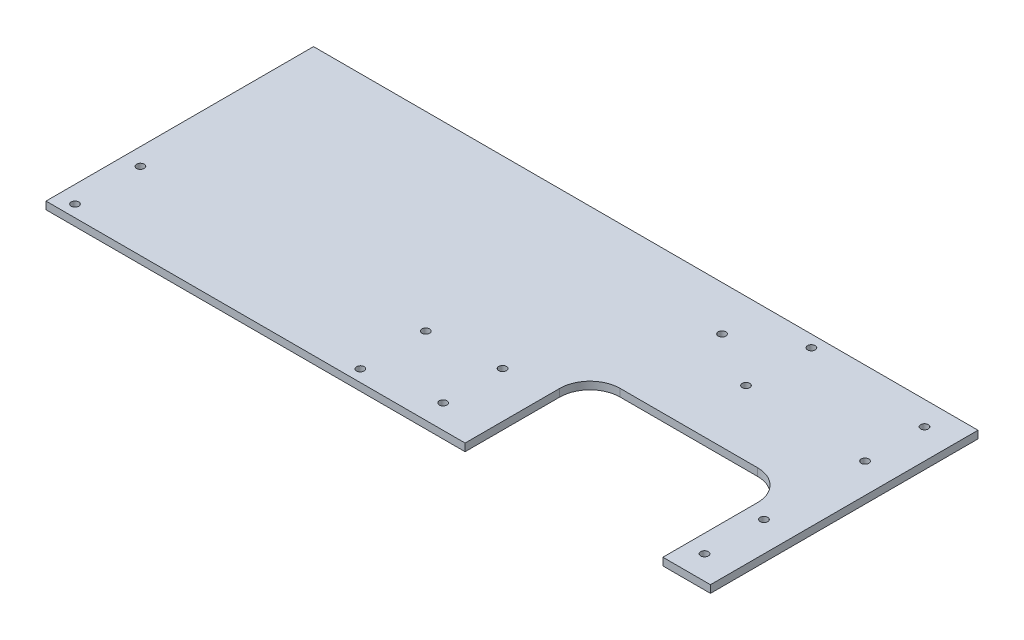
ISO-10303-21;
HEADER;
FILE_DESCRIPTION(('STEP AP214'),'2;1');
FILE_NAME('part.step','',(''),(''),'','','');
FILE_SCHEMA(('AUTOMOTIVE_DESIGN { 1 0 10303 214 1 1 1 1 }'));
ENDSEC;
DATA;
#1=APPLICATION_CONTEXT('core data for automotive mechanical design processes');
#2=APPLICATION_PROTOCOL_DEFINITION('international standard','automotive_design',2000,#1);
#3=PRODUCT_CONTEXT('',#1,'mechanical');
#4=PRODUCT('Part','Part','',(#3));
#5=PRODUCT_RELATED_PRODUCT_CATEGORY('part','',(#4));
#6=PRODUCT_DEFINITION_FORMATION('','',#4);
#7=PRODUCT_DEFINITION_CONTEXT('part definition',#1,'design');
#8=PRODUCT_DEFINITION('design','',#6,#7);
#9=PRODUCT_DEFINITION_SHAPE('','',#8);
#10=(LENGTH_UNIT() NAMED_UNIT(*) SI_UNIT(.MILLI.,.METRE.));
#11=(NAMED_UNIT(*) PLANE_ANGLE_UNIT() SI_UNIT($,.RADIAN.));
#12=(NAMED_UNIT(*) SI_UNIT($,.STERADIAN.) SOLID_ANGLE_UNIT());
#13=UNCERTAINTY_MEASURE_WITH_UNIT(LENGTH_MEASURE(1.E-05),#10,'distance_accuracy_value','');
#14=(GEOMETRIC_REPRESENTATION_CONTEXT(3) GLOBAL_UNCERTAINTY_ASSIGNED_CONTEXT((#13)) GLOBAL_UNIT_ASSIGNED_CONTEXT((#10,
#11,#12)) REPRESENTATION_CONTEXT('',''));
#15=CARTESIAN_POINT('',(0.,0.,0.));
#16=DIRECTION('',(0.,0.,1.));
#17=DIRECTION('',(1.,0.,0.));
#18=AXIS2_PLACEMENT_3D('',#15,#16,#17);
#19=CARTESIAN_POINT('',(-279.4,6.35,112.5));
#20=DIRECTION('',(0.,0.,-1.));
#21=DIRECTION('',(-1.,0.,0.));
#22=AXIS2_PLACEMENT_3D('',#19,#20,#21);
#23=PLANE('',#22);
#24=DIRECTION('',(1.,0.,0.));
#25=VECTOR('',#24,1.);
#26=CARTESIAN_POINT('',(-279.4,6.35,112.5));
#27=LINE('',#26,#25);
#28=CARTESIAN_POINT('',(239.4,6.35,112.5));
#29=VERTEX_POINT('',#28);
#30=CARTESIAN_POINT('',(279.4,6.35,112.5));
#31=VERTEX_POINT('',#30);
#32=EDGE_CURVE('E140',#29,#31,#27,.T.);
#33=ORIENTED_EDGE('',*,*,#32,.F.);
#34=DIRECTION('',(0.,-1.,0.));
#35=VECTOR('',#34,1.);
#36=CARTESIAN_POINT('',(239.4,6.35,112.5));
#37=LINE('',#36,#35);
#38=CARTESIAN_POINT('',(239.4,0.,112.5));
#39=VERTEX_POINT('',#38);
#40=EDGE_CURVE('E131',#29,#39,#37,.T.);
#41=ORIENTED_EDGE('',*,*,#40,.T.);
#42=DIRECTION('',(1.,0.,0.));
#43=VECTOR('',#42,1.);
#44=CARTESIAN_POINT('',(-279.4,0.,112.5));
#45=LINE('',#44,#43);
#46=CARTESIAN_POINT('',(279.4,0.,112.5));
#47=VERTEX_POINT('',#46);
#48=EDGE_CURVE('E155',#39,#47,#45,.T.);
#49=ORIENTED_EDGE('',*,*,#48,.T.);
#50=DIRECTION('',(0.,-1.,0.));
#51=VECTOR('',#50,1.);
#52=CARTESIAN_POINT('',(279.4,6.35,112.5));
#53=LINE('',#52,#51);
#54=EDGE_CURVE('E139',#31,#47,#53,.T.);
#55=ORIENTED_EDGE('',*,*,#54,.F.);
#56=EDGE_LOOP('',(#33,#41,#49,#55));
#57=FACE_BOUND('',#56,.T.);
#58=ADVANCED_FACE('F37',(#57),#23,.F.);
#59=CARTESIAN_POINT('',(279.4,6.35,112.5));
#60=DIRECTION('',(-1.,0.,0.));
#61=DIRECTION('',(0.,0.,1.));
#62=AXIS2_PLACEMENT_3D('',#59,#60,#61);
#63=PLANE('',#62);
#64=DIRECTION('',(0.,0.,-1.));
#65=VECTOR('',#64,1.);
#66=CARTESIAN_POINT('',(279.4,0.,112.5));
#67=LINE('',#66,#65);
#68=CARTESIAN_POINT('',(279.4,0.,-112.5));
#69=VERTEX_POINT('',#68);
#70=EDGE_CURVE('E148',#47,#69,#67,.T.);
#71=ORIENTED_EDGE('',*,*,#70,.T.);
#72=DIRECTION('',(0.,-1.,0.));
#73=VECTOR('',#72,1.);
#74=CARTESIAN_POINT('',(279.4,6.35,-112.5));
#75=LINE('',#74,#73);
#76=CARTESIAN_POINT('',(279.4,6.35,-112.5));
#77=VERTEX_POINT('',#76);
#78=EDGE_CURVE('E162',#77,#69,#75,.T.);
#79=ORIENTED_EDGE('',*,*,#78,.F.);
#80=DIRECTION('',(0.,0.,-1.));
#81=VECTOR('',#80,1.);
#82=CARTESIAN_POINT('',(279.4,6.35,112.5));
#83=LINE('',#82,#81);
#84=EDGE_CURVE('E156',#31,#77,#83,.T.);
#85=ORIENTED_EDGE('',*,*,#84,.F.);
#86=ORIENTED_EDGE('',*,*,#54,.T.);
#87=EDGE_LOOP('',(#71,#79,#85,#86));
#88=FACE_BOUND('',#87,.T.);
#89=ADVANCED_FACE('F197',(#88),#63,.F.);
#90=CARTESIAN_POINT('',(-279.4,6.35,-112.5));
#91=DIRECTION('',(0.,0.,1.));
#92=DIRECTION('',(1.,0.,0.));
#93=AXIS2_PLACEMENT_3D('',#90,#91,#92);
#94=PLANE('',#93);
#95=DIRECTION('',(-1.,0.,0.));
#96=VECTOR('',#95,1.);
#97=CARTESIAN_POINT('',(-279.4,0.,-112.5));
#98=LINE('',#97,#96);
#99=CARTESIAN_POINT('',(-279.4,0.,-112.5));
#100=VERTEX_POINT('',#99);
#101=EDGE_CURVE('E151',#69,#100,#98,.T.);
#102=ORIENTED_EDGE('',*,*,#101,.T.);
#103=DIRECTION('',(0.,-1.,0.));
#104=VECTOR('',#103,1.);
#105=CARTESIAN_POINT('',(-279.4,6.35,-112.5));
#106=LINE('',#105,#104);
#107=CARTESIAN_POINT('',(-279.4,6.35,-112.5));
#108=VERTEX_POINT('',#107);
#109=EDGE_CURVE('E159',#108,#100,#106,.T.);
#110=ORIENTED_EDGE('',*,*,#109,.F.);
#111=DIRECTION('',(-1.,0.,0.));
#112=VECTOR('',#111,1.);
#113=CARTESIAN_POINT('',(-279.4,6.35,-112.5));
#114=LINE('',#113,#112);
#115=EDGE_CURVE('E238',#77,#108,#114,.T.);
#116=ORIENTED_EDGE('',*,*,#115,.F.);
#117=ORIENTED_EDGE('',*,*,#78,.T.);
#118=EDGE_LOOP('',(#102,#110,#116,#117));
#119=FACE_BOUND('',#118,.T.);
#120=ADVANCED_FACE('F203',(#119),#94,.F.);
#121=CARTESIAN_POINT('',(-279.4,6.35,112.5));
#122=DIRECTION('',(1.,0.,0.));
#123=DIRECTION('',(0.,0.,-1.));
#124=AXIS2_PLACEMENT_3D('',#121,#122,#123);
#125=PLANE('',#124);
#126=DIRECTION('',(0.,0.,1.));
#127=VECTOR('',#126,1.);
#128=CARTESIAN_POINT('',(-279.4,0.,112.5));
#129=LINE('',#128,#127);
#130=CARTESIAN_POINT('',(-279.4,0.,112.5));
#131=VERTEX_POINT('',#130);
#132=EDGE_CURVE('E153',#100,#131,#129,.T.);
#133=ORIENTED_EDGE('',*,*,#132,.T.);
#134=DIRECTION('',(0.,-1.,0.));
#135=VECTOR('',#134,1.);
#136=CARTESIAN_POINT('',(-279.4,6.35,112.5));
#137=LINE('',#136,#135);
#138=CARTESIAN_POINT('',(-279.4,6.35,112.5));
#139=VERTEX_POINT('',#138);
#140=EDGE_CURVE('E143',#139,#131,#137,.T.);
#141=ORIENTED_EDGE('',*,*,#140,.F.);
#142=DIRECTION('',(0.,0.,1.));
#143=VECTOR('',#142,1.);
#144=CARTESIAN_POINT('',(-279.4,6.35,112.5));
#145=LINE('',#144,#143);
#146=EDGE_CURVE('E137',#108,#139,#145,.T.);
#147=ORIENTED_EDGE('',*,*,#146,.F.);
#148=ORIENTED_EDGE('',*,*,#109,.T.);
#149=EDGE_LOOP('',(#133,#141,#147,#148));
#150=FACE_BOUND('',#149,.T.);
#151=ADVANCED_FACE('F210',(#150),#125,.F.);
#152=CARTESIAN_POINT('',(73.05,0.,112.5));
#153=VERTEX_POINT('',#152);
#154=EDGE_CURVE('E130',#131,#153,#45,.T.);
#155=ORIENTED_EDGE('',*,*,#154,.T.);
#156=DIRECTION('',(0.,1.,0.));
#157=VECTOR('',#156,1.);
#158=CARTESIAN_POINT('',(73.05,6.35,112.5));
#159=LINE('',#158,#157);
#160=CARTESIAN_POINT('',(73.05,6.35,112.5));
#161=VERTEX_POINT('',#160);
#162=EDGE_CURVE('E116',#153,#161,#159,.T.);
#163=ORIENTED_EDGE('',*,*,#162,.T.);
#164=EDGE_CURVE('E128',#139,#161,#27,.T.);
#165=ORIENTED_EDGE('',*,*,#164,.F.);
#166=ORIENTED_EDGE('',*,*,#140,.T.);
#167=EDGE_LOOP('',(#155,#163,#165,#166));
#168=FACE_BOUND('',#167,.T.);
#169=ADVANCED_FACE('F126',(#168),#23,.F.);
#170=CARTESIAN_POINT('',(0.,6.35,0.));
#171=DIRECTION('',(0.,-1.,0.));
#172=DIRECTION('',(0.,0.,-1.));
#173=AXIS2_PLACEMENT_3D('',#170,#171,#172);
#174=PLANE('',#173);
#175=CARTESIAN_POINT('',(101.644095194573,6.35,-74.9999999999954));
#176=DIRECTION('',(0.,1.,0.));
#177=DIRECTION('',(0.,0.,1.));
#178=AXIS2_PLACEMENT_3D('',#175,#176,#177);
#179=CIRCLE('',#178,3.19999999999915);
#180=CARTESIAN_POINT('',(101.644095194573,6.35,-71.7999999999963));
#181=VERTEX_POINT('',#180);
#182=EDGE_CURVE('E413',#181,#181,#179,.T.);
#183=ORIENTED_EDGE('',*,*,#182,.F.);
#184=EDGE_LOOP('',(#183));
#185=FACE_BOUND('',#184,.T.);
#186=CARTESIAN_POINT('',(-25.0171688775977,6.35,102.500000000004));
#187=DIRECTION('',(0.,1.,0.));
#188=DIRECTION('',(0.,0.,1.));
#189=AXIS2_PLACEMENT_3D('',#186,#187,#188);
#190=CIRCLE('',#189,3.19999999999915);
#191=CARTESIAN_POINT('',(-25.0171688775977,6.35,105.700000000004));
#192=VERTEX_POINT('',#191);
#193=EDGE_CURVE('E416',#192,#192,#190,.T.);
#194=ORIENTED_EDGE('',*,*,#193,.F.);
#195=EDGE_LOOP('',(#194));
#196=FACE_BOUND('',#195,.T.);
#197=CARTESIAN_POINT('',(-25.0171688775977,6.35,47.5000000000044));
#198=DIRECTION('',(0.,1.,0.));
#199=DIRECTION('',(0.,0.,1.));
#200=AXIS2_PLACEMENT_3D('',#197,#198,#199);
#201=CIRCLE('',#200,3.19999999999915);
#202=CARTESIAN_POINT('',(-25.0171688775977,6.35,50.7000000000035));
#203=VERTEX_POINT('',#202);
#204=EDGE_CURVE('E433',#203,#203,#201,.T.);
#205=ORIENTED_EDGE('',*,*,#204,.F.);
#206=EDGE_LOOP('',(#205));
#207=FACE_BOUND('',#206,.T.);
#208=CARTESIAN_POINT('',(-265.017168877598,6.35,47.5000000000044));
#209=DIRECTION('',(0.,1.,0.));
#210=DIRECTION('',(0.,0.,1.));
#211=AXIS2_PLACEMENT_3D('',#208,#209,#210);
#212=CIRCLE('',#211,3.19999999999914);
#213=CARTESIAN_POINT('',(-265.017168877598,6.35,50.7000000000035));
#214=VERTEX_POINT('',#213);
#215=EDGE_CURVE('E427',#214,#214,#212,.T.);
#216=ORIENTED_EDGE('',*,*,#215,.F.);
#217=EDGE_LOOP('',(#216));
#218=FACE_BOUND('',#217,.T.);
#219=CARTESIAN_POINT('',(149.275492402717,6.35,-102.499999999996));
#220=DIRECTION('',(0.,1.,0.));
#221=DIRECTION('',(0.,0.,1.));
#222=AXIS2_PLACEMENT_3D('',#219,#220,#221);
#223=CIRCLE('',#222,3.19999999999916);
#224=CARTESIAN_POINT('',(149.275492402717,6.35,-99.2999999999964));
#225=VERTEX_POINT('',#224);
#226=EDGE_CURVE('E419',#225,#225,#223,.T.);
#227=ORIENTED_EDGE('',*,*,#226,.F.);
#228=EDGE_LOOP('',(#227));
#229=FACE_BOUND('',#228,.T.);
#230=CARTESIAN_POINT('',(149.275492402717,6.35,-47.4999999999955));
#231=DIRECTION('',(0.,1.,0.));
#232=DIRECTION('',(0.,0.,1.));
#233=AXIS2_PLACEMENT_3D('',#230,#231,#232);
#234=CIRCLE('',#233,3.19999999999913);
#235=CARTESIAN_POINT('',(149.275492402717,6.35,-44.2999999999964));
#236=VERTEX_POINT('',#235);
#237=EDGE_CURVE('E442',#236,#236,#234,.T.);
#238=ORIENTED_EDGE('',*,*,#237,.F.);
#239=EDGE_LOOP('',(#238));
#240=FACE_BOUND('',#239,.T.);
#241=CARTESIAN_POINT('',(254.400000000002,6.35,-92.4999999999956));
#242=DIRECTION('',(0.,1.,0.));
#243=DIRECTION('',(0.,0.,1.));
#244=AXIS2_PLACEMENT_3D('',#241,#242,#243);
#245=CIRCLE('',#244,3.19999999999913);
#246=CARTESIAN_POINT('',(254.400000000002,6.35,-89.2999999999965));
#247=VERTEX_POINT('',#246);
#248=EDGE_CURVE('E448',#247,#247,#245,.T.);
#249=ORIENTED_EDGE('',*,*,#248,.F.);
#250=EDGE_LOOP('',(#249));
#251=FACE_BOUND('',#250,.T.);
#252=CARTESIAN_POINT('',(254.400000000002,6.35,-42.4999999999956));
#253=DIRECTION('',(0.,1.,0.));
#254=DIRECTION('',(0.,0.,1.));
#255=AXIS2_PLACEMENT_3D('',#252,#253,#254);
#256=CIRCLE('',#255,3.19999999999913);
#257=CARTESIAN_POINT('',(254.400000000002,6.35,-39.2999999999965));
#258=VERTEX_POINT('',#257);
#259=EDGE_CURVE('E454',#258,#258,#256,.T.);
#260=ORIENTED_EDGE('',*,*,#259,.F.);
#261=EDGE_LOOP('',(#260));
#262=FACE_BOUND('',#261,.T.);
#263=CARTESIAN_POINT('',(254.400000000002,6.35,42.5000000000063));
#264=DIRECTION('',(0.,1.,0.));
#265=DIRECTION('',(0.,0.,1.));
#266=AXIS2_PLACEMENT_3D('',#263,#264,#265);
#267=CIRCLE('',#266,3.19999999999983);
#268=CARTESIAN_POINT('',(254.400000000002,6.35,45.7000000000061));
#269=VERTEX_POINT('',#268);
#270=EDGE_CURVE('E468',#269,#269,#267,.T.);
#271=ORIENTED_EDGE('',*,*,#270,.F.);
#272=EDGE_LOOP('',(#271));
#273=FACE_BOUND('',#272,.T.);
#274=CARTESIAN_POINT('',(254.400000000002,6.35,92.5000000000063));
#275=DIRECTION('',(0.,1.,0.));
#276=DIRECTION('',(0.,0.,1.));
#277=AXIS2_PLACEMENT_3D('',#274,#275,#276);
#278=CIRCLE('',#277,3.19999999999989);
#279=CARTESIAN_POINT('',(254.400000000002,6.35,95.7000000000062));
#280=VERTEX_POINT('',#279);
#281=EDGE_CURVE('E478',#280,#280,#278,.T.);
#282=ORIENTED_EDGE('',*,*,#281,.F.);
#283=EDGE_LOOP('',(#282));
#284=FACE_BOUND('',#283,.T.);
#285=CARTESIAN_POINT('',(34.5750000000003,6.35,42.5000000000044));
#286=DIRECTION('',(0.,1.,0.));
#287=DIRECTION('',(0.,0.,1.));
#288=AXIS2_PLACEMENT_3D('',#285,#286,#287);
#289=CIRCLE('',#288,3.20000000000123);
#290=CARTESIAN_POINT('',(34.5750000000003,6.35,45.7000000000056));
#291=VERTEX_POINT('',#290);
#292=EDGE_CURVE('E484',#291,#291,#289,.T.);
#293=ORIENTED_EDGE('',*,*,#292,.F.);
#294=EDGE_LOOP('',(#293));
#295=FACE_BOUND('',#294,.T.);
#296=CARTESIAN_POINT('',(34.5750000000003,6.35,92.5000000000044));
#297=DIRECTION('',(0.,1.,0.));
#298=DIRECTION('',(0.,0.,1.));
#299=AXIS2_PLACEMENT_3D('',#296,#297,#298);
#300=CIRCLE('',#299,3.20000000000124);
#301=CARTESIAN_POINT('',(34.5750000000003,6.35,95.7000000000056));
#302=VERTEX_POINT('',#301);
#303=EDGE_CURVE('E490',#302,#302,#300,.T.);
#304=ORIENTED_EDGE('',*,*,#303,.F.);
#305=EDGE_LOOP('',(#304));
#306=FACE_BOUND('',#305,.T.);
#307=CARTESIAN_POINT('',(-265.017168877598,6.35,102.500000000004));
#308=DIRECTION('',(0.,1.,0.));
#309=DIRECTION('',(0.,0.,1.));
#310=AXIS2_PLACEMENT_3D('',#307,#308,#309);
#311=CIRCLE('',#310,3.19999999999914);
#312=CARTESIAN_POINT('',(-265.017168877598,6.35,105.700000000004));
#313=VERTEX_POINT('',#312);
#314=EDGE_CURVE('E426',#313,#313,#311,.T.);
#315=ORIENTED_EDGE('',*,*,#314,.F.);
#316=EDGE_LOOP('',(#315));
#317=FACE_BOUND('',#316,.T.);
#318=DIRECTION('',(-1.,0.,0.));
#319=VECTOR('',#318,1.);
#320=CARTESIAN_POINT('',(73.05,6.35,7.50000000000104));
#321=LINE('',#320,#319);
#322=CARTESIAN_POINT('',(214.,6.35,7.50000000000105));
#323=VERTEX_POINT('',#322);
#324=CARTESIAN_POINT('',(98.45,6.35,7.50000000000105));
#325=VERTEX_POINT('',#324);
#326=EDGE_CURVE('E122',#323,#325,#321,.T.);
#327=ORIENTED_EDGE('',*,*,#326,.F.);
#328=CARTESIAN_POINT('',(214.,6.35,32.900000000001));
#329=DIRECTION('',(0.,-1.,0.));
#330=DIRECTION('',(0.,0.,-1.));
#331=AXIS2_PLACEMENT_3D('',#328,#329,#330);
#332=CIRCLE('',#331,25.4);
#333=CARTESIAN_POINT('',(239.4,6.35,32.900000000001));
#334=VERTEX_POINT('',#333);
#335=EDGE_CURVE('E175',#323,#334,#332,.T.);
#336=ORIENTED_EDGE('',*,*,#335,.T.);
#337=DIRECTION('',(0.,0.,-1.));
#338=VECTOR('',#337,1.);
#339=CARTESIAN_POINT('',(239.4,6.35,7.50000000000105));
#340=LINE('',#339,#338);
#341=EDGE_CURVE('E121',#29,#334,#340,.T.);
#342=ORIENTED_EDGE('',*,*,#341,.F.);
#343=ORIENTED_EDGE('',*,*,#32,.T.);
#344=ORIENTED_EDGE('',*,*,#84,.T.);
#345=ORIENTED_EDGE('',*,*,#115,.T.);
#346=ORIENTED_EDGE('',*,*,#146,.T.);
#347=ORIENTED_EDGE('',*,*,#164,.T.);
#348=DIRECTION('',(0.,0.,1.));
#349=VECTOR('',#348,1.);
#350=CARTESIAN_POINT('',(73.05,6.35,7.50000000000104));
#351=LINE('',#350,#349);
#352=CARTESIAN_POINT('',(73.05,6.35,32.900000000001));
#353=VERTEX_POINT('',#352);
#354=EDGE_CURVE('E113',#353,#161,#351,.T.);
#355=ORIENTED_EDGE('',*,*,#354,.F.);
#356=CARTESIAN_POINT('',(98.45,6.35,32.900000000001));
#357=DIRECTION('',(0.,-1.,0.));
#358=DIRECTION('',(0.,0.,-1.));
#359=AXIS2_PLACEMENT_3D('',#356,#357,#358);
#360=CIRCLE('',#359,25.4);
#361=EDGE_CURVE('E45',#353,#325,#360,.T.);
#362=ORIENTED_EDGE('',*,*,#361,.T.);
#363=EDGE_LOOP('',(#327,#336,#342,#343,#344,#345,#346,#347,#355,#362));
#364=FACE_BOUND('',#363,.T.);
#365=ADVANCED_FACE('F135',(#185,#196,#207,#218,#229,#240,#251,#262,#273,#284,#295,#306,#317,
#364),#174,.F.);
#366=CARTESIAN_POINT('',(0.,0.,0.));
#367=DIRECTION('',(0.,-1.,0.));
#368=DIRECTION('',(0.,0.,-1.));
#369=AXIS2_PLACEMENT_3D('',#366,#367,#368);
#370=PLANE('',#369);
#371=CARTESIAN_POINT('',(101.644095194573,0.,-74.9999999999954));
#372=DIRECTION('',(0.,1.,0.));
#373=DIRECTION('',(0.,0.,1.));
#374=AXIS2_PLACEMENT_3D('',#371,#372,#373);
#375=CIRCLE('',#374,3.19999999999915);
#376=CARTESIAN_POINT('',(101.644095194573,0.,-71.7999999999963));
#377=VERTEX_POINT('',#376);
#378=EDGE_CURVE('E410',#377,#377,#375,.T.);
#379=ORIENTED_EDGE('',*,*,#378,.T.);
#380=EDGE_LOOP('',(#379));
#381=FACE_BOUND('',#380,.T.);
#382=CARTESIAN_POINT('',(-25.0171688775977,0.,102.500000000004));
#383=DIRECTION('',(0.,1.,0.));
#384=DIRECTION('',(0.,0.,1.));
#385=AXIS2_PLACEMENT_3D('',#382,#383,#384);
#386=CIRCLE('',#385,3.19999999999915);
#387=CARTESIAN_POINT('',(-25.0171688775977,0.,105.700000000004));
#388=VERTEX_POINT('',#387);
#389=EDGE_CURVE('E435',#388,#388,#386,.T.);
#390=ORIENTED_EDGE('',*,*,#389,.T.);
#391=EDGE_LOOP('',(#390));
#392=FACE_BOUND('',#391,.T.);
#393=CARTESIAN_POINT('',(-25.0171688775977,0.,47.5000000000044));
#394=DIRECTION('',(0.,1.,0.));
#395=DIRECTION('',(0.,0.,1.));
#396=AXIS2_PLACEMENT_3D('',#393,#394,#395);
#397=CIRCLE('',#396,3.19999999999915);
#398=CARTESIAN_POINT('',(-25.0171688775977,0.,50.7000000000035));
#399=VERTEX_POINT('',#398);
#400=EDGE_CURVE('E430',#399,#399,#397,.T.);
#401=ORIENTED_EDGE('',*,*,#400,.T.);
#402=EDGE_LOOP('',(#401));
#403=FACE_BOUND('',#402,.T.);
#404=CARTESIAN_POINT('',(-265.017168877598,0.,47.5000000000044));
#405=DIRECTION('',(0.,1.,0.));
#406=DIRECTION('',(0.,0.,1.));
#407=AXIS2_PLACEMENT_3D('',#404,#405,#406);
#408=CIRCLE('',#407,3.19999999999914);
#409=CARTESIAN_POINT('',(-265.017168877598,0.,50.7000000000035));
#410=VERTEX_POINT('',#409);
#411=EDGE_CURVE('E423',#410,#410,#408,.T.);
#412=ORIENTED_EDGE('',*,*,#411,.T.);
#413=EDGE_LOOP('',(#412));
#414=FACE_BOUND('',#413,.T.);
#415=CARTESIAN_POINT('',(149.275492402717,0.,-102.499999999996));
#416=DIRECTION('',(0.,1.,0.));
#417=DIRECTION('',(0.,0.,1.));
#418=AXIS2_PLACEMENT_3D('',#415,#416,#417);
#419=CIRCLE('',#418,3.19999999999916);
#420=CARTESIAN_POINT('',(149.275492402717,0.,-99.2999999999964));
#421=VERTEX_POINT('',#420);
#422=EDGE_CURVE('E414',#421,#421,#419,.T.);
#423=ORIENTED_EDGE('',*,*,#422,.T.);
#424=EDGE_LOOP('',(#423));
#425=FACE_BOUND('',#424,.T.);
#426=CARTESIAN_POINT('',(149.275492402717,0.,-47.4999999999955));
#427=DIRECTION('',(0.,1.,0.));
#428=DIRECTION('',(0.,0.,1.));
#429=AXIS2_PLACEMENT_3D('',#426,#427,#428);
#430=CIRCLE('',#429,3.19999999999913);
#431=CARTESIAN_POINT('',(149.275492402717,0.,-44.2999999999964));
#432=VERTEX_POINT('',#431);
#433=EDGE_CURVE('E439',#432,#432,#430,.T.);
#434=ORIENTED_EDGE('',*,*,#433,.T.);
#435=EDGE_LOOP('',(#434));
#436=FACE_BOUND('',#435,.T.);
#437=CARTESIAN_POINT('',(254.400000000002,0.,-92.4999999999956));
#438=DIRECTION('',(0.,1.,0.));
#439=DIRECTION('',(0.,0.,1.));
#440=AXIS2_PLACEMENT_3D('',#437,#438,#439);
#441=CIRCLE('',#440,3.19999999999913);
#442=CARTESIAN_POINT('',(254.400000000002,0.,-89.2999999999965));
#443=VERTEX_POINT('',#442);
#444=EDGE_CURVE('E445',#443,#443,#441,.T.);
#445=ORIENTED_EDGE('',*,*,#444,.T.);
#446=EDGE_LOOP('',(#445));
#447=FACE_BOUND('',#446,.T.);
#448=CARTESIAN_POINT('',(254.400000000002,0.,-42.4999999999956));
#449=DIRECTION('',(0.,1.,0.));
#450=DIRECTION('',(0.,0.,1.));
#451=AXIS2_PLACEMENT_3D('',#448,#449,#450);
#452=CIRCLE('',#451,3.19999999999913);
#453=CARTESIAN_POINT('',(254.400000000002,0.,-39.2999999999965));
#454=VERTEX_POINT('',#453);
#455=EDGE_CURVE('E451',#454,#454,#452,.T.);
#456=ORIENTED_EDGE('',*,*,#455,.T.);
#457=EDGE_LOOP('',(#456));
#458=FACE_BOUND('',#457,.T.);
#459=CARTESIAN_POINT('',(254.400000000002,0.,42.5000000000063));
#460=DIRECTION('',(0.,1.,0.));
#461=DIRECTION('',(0.,0.,1.));
#462=AXIS2_PLACEMENT_3D('',#459,#460,#461);
#463=CIRCLE('',#462,3.19999999999983);
#464=CARTESIAN_POINT('',(254.400000000002,0.,45.7000000000061));
#465=VERTEX_POINT('',#464);
#466=EDGE_CURVE('E457',#465,#465,#463,.T.);
#467=ORIENTED_EDGE('',*,*,#466,.T.);
#468=EDGE_LOOP('',(#467));
#469=FACE_BOUND('',#468,.T.);
#470=CARTESIAN_POINT('',(254.400000000002,0.,92.5000000000063));
#471=DIRECTION('',(0.,1.,0.));
#472=DIRECTION('',(0.,0.,1.));
#473=AXIS2_PLACEMENT_3D('',#470,#471,#472);
#474=CIRCLE('',#473,3.19999999999989);
#475=CARTESIAN_POINT('',(254.400000000002,0.,95.7000000000062));
#476=VERTEX_POINT('',#475);
#477=EDGE_CURVE('E473',#476,#476,#474,.T.);
#478=ORIENTED_EDGE('',*,*,#477,.T.);
#479=EDGE_LOOP('',(#478));
#480=FACE_BOUND('',#479,.T.);
#481=CARTESIAN_POINT('',(34.5750000000003,0.,42.5000000000044));
#482=DIRECTION('',(0.,1.,0.));
#483=DIRECTION('',(0.,0.,1.));
#484=AXIS2_PLACEMENT_3D('',#481,#482,#483);
#485=CIRCLE('',#484,3.20000000000123);
#486=CARTESIAN_POINT('',(34.5750000000003,0.,45.7000000000056));
#487=VERTEX_POINT('',#486);
#488=EDGE_CURVE('E481',#487,#487,#485,.T.);
#489=ORIENTED_EDGE('',*,*,#488,.T.);
#490=EDGE_LOOP('',(#489));
#491=FACE_BOUND('',#490,.T.);
#492=CARTESIAN_POINT('',(34.5750000000003,0.,92.5000000000044));
#493=DIRECTION('',(0.,1.,0.));
#494=DIRECTION('',(0.,0.,1.));
#495=AXIS2_PLACEMENT_3D('',#492,#493,#494);
#496=CIRCLE('',#495,3.20000000000124);
#497=CARTESIAN_POINT('',(34.5750000000003,0.,95.7000000000056));
#498=VERTEX_POINT('',#497);
#499=EDGE_CURVE('E487',#498,#498,#496,.T.);
#500=ORIENTED_EDGE('',*,*,#499,.T.);
#501=EDGE_LOOP('',(#500));
#502=FACE_BOUND('',#501,.T.);
#503=CARTESIAN_POINT('',(-265.017168877598,0.,102.500000000004));
#504=DIRECTION('',(0.,1.,0.));
#505=DIRECTION('',(0.,0.,1.));
#506=AXIS2_PLACEMENT_3D('',#503,#504,#505);
#507=CIRCLE('',#506,3.19999999999914);
#508=CARTESIAN_POINT('',(-265.017168877598,0.,105.700000000004));
#509=VERTEX_POINT('',#508);
#510=EDGE_CURVE('E183',#509,#509,#507,.T.);
#511=ORIENTED_EDGE('',*,*,#510,.T.);
#512=EDGE_LOOP('',(#511));
#513=FACE_BOUND('',#512,.T.);
#514=DIRECTION('',(0.,0.,1.));
#515=VECTOR('',#514,1.);
#516=CARTESIAN_POINT('',(239.4,0.,0.));
#517=LINE('',#516,#515);
#518=CARTESIAN_POINT('',(239.4,0.,32.900000000001));
#519=VERTEX_POINT('',#518);
#520=EDGE_CURVE('E165',#519,#39,#517,.T.);
#521=ORIENTED_EDGE('',*,*,#520,.F.);
#522=CARTESIAN_POINT('',(214.,0.,32.900000000001));
#523=DIRECTION('',(0.,-1.,0.));
#524=DIRECTION('',(0.,0.,-1.));
#525=AXIS2_PLACEMENT_3D('',#522,#523,#524);
#526=CIRCLE('',#525,25.4);
#527=CARTESIAN_POINT('',(214.,0.,7.50000000000105));
#528=VERTEX_POINT('',#527);
#529=EDGE_CURVE('E177',#519,#528,#526,.F.);
#530=ORIENTED_EDGE('',*,*,#529,.T.);
#531=DIRECTION('',(-1.,0.,0.));
#532=VECTOR('',#531,1.);
#533=CARTESIAN_POINT('',(73.05,0.,7.50000000000104));
#534=LINE('',#533,#532);
#535=CARTESIAN_POINT('',(98.45,0.,7.50000000000105));
#536=VERTEX_POINT('',#535);
#537=EDGE_CURVE('E228',#528,#536,#534,.T.);
#538=ORIENTED_EDGE('',*,*,#537,.T.);
#539=CARTESIAN_POINT('',(98.45,0.,32.900000000001));
#540=DIRECTION('',(0.,-1.,0.));
#541=DIRECTION('',(0.,0.,-1.));
#542=AXIS2_PLACEMENT_3D('',#539,#540,#541);
#543=CIRCLE('',#542,25.4);
#544=CARTESIAN_POINT('',(73.05,0.,32.900000000001));
#545=VERTEX_POINT('',#544);
#546=EDGE_CURVE('E11',#536,#545,#543,.F.);
#547=ORIENTED_EDGE('',*,*,#546,.T.);
#548=DIRECTION('',(0.,0.,1.));
#549=VECTOR('',#548,1.);
#550=CARTESIAN_POINT('',(73.05,0.,7.50000000000104));
#551=LINE('',#550,#549);
#552=EDGE_CURVE('E132',#545,#153,#551,.T.);
#553=ORIENTED_EDGE('',*,*,#552,.T.);
#554=ORIENTED_EDGE('',*,*,#154,.F.);
#555=ORIENTED_EDGE('',*,*,#132,.F.);
#556=ORIENTED_EDGE('',*,*,#101,.F.);
#557=ORIENTED_EDGE('',*,*,#70,.F.);
#558=ORIENTED_EDGE('',*,*,#48,.F.);
#559=EDGE_LOOP('',(#521,#530,#538,#547,#553,#554,#555,#556,#557,#558));
#560=FACE_BOUND('',#559,.T.);
#561=ADVANCED_FACE('F216',(#381,#392,#403,#414,#425,#436,#447,#458,#469,#480,#491,#502,#513,
#560),#370,.T.);
#562=CARTESIAN_POINT('',(239.4,0.,7.50000000000105));
#563=DIRECTION('',(1.,0.,0.));
#564=DIRECTION('',(0.,0.,-1.));
#565=AXIS2_PLACEMENT_3D('',#562,#563,#564);
#566=PLANE('',#565);
#567=ORIENTED_EDGE('',*,*,#341,.T.);
#568=DIRECTION('',(0.,1.,0.));
#569=VECTOR('',#568,1.);
#570=CARTESIAN_POINT('',(239.4,0.,32.900000000001));
#571=LINE('',#570,#569);
#572=EDGE_CURVE('E172',#334,#519,#571,.F.);
#573=ORIENTED_EDGE('',*,*,#572,.T.);
#574=ORIENTED_EDGE('',*,*,#520,.T.);
#575=ORIENTED_EDGE('',*,*,#40,.F.);
#576=EDGE_LOOP('',(#567,#573,#574,#575));
#577=FACE_BOUND('',#576,.T.);
#578=ADVANCED_FACE('F246',(#577),#566,.F.);
#579=CARTESIAN_POINT('',(73.05,0.,7.50000000000104));
#580=DIRECTION('',(-1.,0.,0.));
#581=DIRECTION('',(0.,0.,1.));
#582=AXIS2_PLACEMENT_3D('',#579,#580,#581);
#583=PLANE('',#582);
#584=ORIENTED_EDGE('',*,*,#552,.F.);
#585=DIRECTION('',(0.,1.,0.));
#586=VECTOR('',#585,1.);
#587=CARTESIAN_POINT('',(73.05,6.35,32.900000000001));
#588=LINE('',#587,#586);
#589=EDGE_CURVE('E118',#545,#353,#588,.T.);
#590=ORIENTED_EDGE('',*,*,#589,.T.);
#591=ORIENTED_EDGE('',*,*,#354,.T.);
#592=ORIENTED_EDGE('',*,*,#162,.F.);
#593=EDGE_LOOP('',(#584,#590,#591,#592));
#594=FACE_BOUND('',#593,.T.);
#595=ADVANCED_FACE('F115',(#594),#583,.F.);
#596=CARTESIAN_POINT('',(73.05,0.,7.50000000000104));
#597=DIRECTION('',(0.,0.,-1.));
#598=DIRECTION('',(-1.,0.,0.));
#599=AXIS2_PLACEMENT_3D('',#596,#597,#598);
#600=PLANE('',#599);
#601=ORIENTED_EDGE('',*,*,#537,.F.);
#602=DIRECTION('',(0.,1.,0.));
#603=VECTOR('',#602,1.);
#604=CARTESIAN_POINT('',(214.,6.35,7.50000000000105));
#605=LINE('',#604,#603);
#606=EDGE_CURVE('E169',#528,#323,#605,.T.);
#607=ORIENTED_EDGE('',*,*,#606,.T.);
#608=ORIENTED_EDGE('',*,*,#326,.T.);
#609=DIRECTION('',(0.,1.,0.));
#610=VECTOR('',#609,1.);
#611=CARTESIAN_POINT('',(98.45,0.,7.50000000000104));
#612=LINE('',#611,#610);
#613=EDGE_CURVE('E167',#325,#536,#612,.F.);
#614=ORIENTED_EDGE('',*,*,#613,.T.);
#615=EDGE_LOOP('',(#601,#607,#608,#614));
#616=FACE_BOUND('',#615,.T.);
#617=ADVANCED_FACE('F181',(#616),#600,.F.);
#618=CARTESIAN_POINT('',(214.,0.,32.900000000001));
#619=DIRECTION('',(0.,-1.,0.));
#620=DIRECTION('',(0.,0.,-1.));
#621=AXIS2_PLACEMENT_3D('',#618,#619,#620);
#622=CYLINDRICAL_SURFACE('',#621,25.4);
#623=ORIENTED_EDGE('',*,*,#529,.F.);
#624=ORIENTED_EDGE('',*,*,#572,.F.);
#625=ORIENTED_EDGE('',*,*,#335,.F.);
#626=ORIENTED_EDGE('',*,*,#606,.F.);
#627=EDGE_LOOP('',(#623,#624,#625,#626));
#628=FACE_BOUND('',#627,.T.);
#629=ADVANCED_FACE('F187',(#628),#622,.F.);
#630=CARTESIAN_POINT('',(98.45,0.,32.900000000001));
#631=DIRECTION('',(0.,-1.,0.));
#632=DIRECTION('',(0.,0.,-1.));
#633=AXIS2_PLACEMENT_3D('',#630,#631,#632);
#634=CYLINDRICAL_SURFACE('',#633,25.4);
#635=ORIENTED_EDGE('',*,*,#546,.F.);
#636=ORIENTED_EDGE('',*,*,#613,.F.);
#637=ORIENTED_EDGE('',*,*,#361,.F.);
#638=ORIENTED_EDGE('',*,*,#589,.F.);
#639=EDGE_LOOP('',(#635,#636,#637,#638));
#640=FACE_BOUND('',#639,.T.);
#641=ADVANCED_FACE('F39',(#640),#634,.F.);
#642=CARTESIAN_POINT('',(-265.017168877598,0.,102.500000000004));
#643=DIRECTION('',(0.,1.,0.));
#644=DIRECTION('',(0.,0.,1.));
#645=AXIS2_PLACEMENT_3D('',#642,#643,#644);
#646=CYLINDRICAL_SURFACE('',#645,3.19999999999914);
#647=ORIENTED_EDGE('',*,*,#510,.F.);
#648=EDGE_LOOP('',(#647));
#649=FACE_BOUND('',#648,.T.);
#650=ORIENTED_EDGE('',*,*,#314,.T.);
#651=EDGE_LOOP('',(#650));
#652=FACE_BOUND('',#651,.T.);
#653=ADVANCED_FACE('F186',(#649,#652),#646,.F.);
#654=CARTESIAN_POINT('',(34.5750000000003,0.,92.5000000000044));
#655=DIRECTION('',(0.,1.,0.));
#656=DIRECTION('',(0.,0.,1.));
#657=AXIS2_PLACEMENT_3D('',#654,#655,#656);
#658=CYLINDRICAL_SURFACE('',#657,3.20000000000124);
#659=ORIENTED_EDGE('',*,*,#499,.F.);
#660=EDGE_LOOP('',(#659));
#661=FACE_BOUND('',#660,.T.);
#662=ORIENTED_EDGE('',*,*,#303,.T.);
#663=EDGE_LOOP('',(#662));
#664=FACE_BOUND('',#663,.T.);
#665=ADVANCED_FACE('F192',(#661,#664),#658,.F.);
#666=CARTESIAN_POINT('',(34.5750000000003,0.,42.5000000000044));
#667=DIRECTION('',(0.,1.,0.));
#668=DIRECTION('',(0.,0.,1.));
#669=AXIS2_PLACEMENT_3D('',#666,#667,#668);
#670=CYLINDRICAL_SURFACE('',#669,3.20000000000123);
#671=ORIENTED_EDGE('',*,*,#488,.F.);
#672=EDGE_LOOP('',(#671));
#673=FACE_BOUND('',#672,.T.);
#674=ORIENTED_EDGE('',*,*,#292,.T.);
#675=EDGE_LOOP('',(#674));
#676=FACE_BOUND('',#675,.T.);
#677=ADVANCED_FACE('F294',(#673,#676),#670,.F.);
#678=CARTESIAN_POINT('',(254.400000000002,0.,92.5000000000063));
#679=DIRECTION('',(0.,1.,0.));
#680=DIRECTION('',(0.,0.,1.));
#681=AXIS2_PLACEMENT_3D('',#678,#679,#680);
#682=CYLINDRICAL_SURFACE('',#681,3.19999999999989);
#683=ORIENTED_EDGE('',*,*,#477,.F.);
#684=EDGE_LOOP('',(#683));
#685=FACE_BOUND('',#684,.T.);
#686=ORIENTED_EDGE('',*,*,#281,.T.);
#687=EDGE_LOOP('',(#686));
#688=FACE_BOUND('',#687,.T.);
#689=ADVANCED_FACE('F304',(#685,#688),#682,.F.);
#690=CARTESIAN_POINT('',(254.400000000002,0.,42.5000000000063));
#691=DIRECTION('',(0.,1.,0.));
#692=DIRECTION('',(0.,0.,1.));
#693=AXIS2_PLACEMENT_3D('',#690,#691,#692);
#694=CYLINDRICAL_SURFACE('',#693,3.19999999999983);
#695=ORIENTED_EDGE('',*,*,#466,.F.);
#696=EDGE_LOOP('',(#695));
#697=FACE_BOUND('',#696,.T.);
#698=ORIENTED_EDGE('',*,*,#270,.T.);
#699=EDGE_LOOP('',(#698));
#700=FACE_BOUND('',#699,.T.);
#701=ADVANCED_FACE('F314',(#697,#700),#694,.F.);
#702=CARTESIAN_POINT('',(254.400000000002,0.,-42.4999999999956));
#703=DIRECTION('',(0.,1.,0.));
#704=DIRECTION('',(0.,0.,1.));
#705=AXIS2_PLACEMENT_3D('',#702,#703,#704);
#706=CYLINDRICAL_SURFACE('',#705,3.19999999999913);
#707=ORIENTED_EDGE('',*,*,#455,.F.);
#708=EDGE_LOOP('',(#707));
#709=FACE_BOUND('',#708,.T.);
#710=ORIENTED_EDGE('',*,*,#259,.T.);
#711=EDGE_LOOP('',(#710));
#712=FACE_BOUND('',#711,.T.);
#713=ADVANCED_FACE('F324',(#709,#712),#706,.F.);
#714=CARTESIAN_POINT('',(254.400000000002,0.,-92.4999999999956));
#715=DIRECTION('',(0.,1.,0.));
#716=DIRECTION('',(0.,0.,1.));
#717=AXIS2_PLACEMENT_3D('',#714,#715,#716);
#718=CYLINDRICAL_SURFACE('',#717,3.19999999999913);
#719=ORIENTED_EDGE('',*,*,#444,.F.);
#720=EDGE_LOOP('',(#719));
#721=FACE_BOUND('',#720,.T.);
#722=ORIENTED_EDGE('',*,*,#248,.T.);
#723=EDGE_LOOP('',(#722));
#724=FACE_BOUND('',#723,.T.);
#725=ADVANCED_FACE('F334',(#721,#724),#718,.F.);
#726=CARTESIAN_POINT('',(149.275492402717,0.,-47.4999999999955));
#727=DIRECTION('',(0.,1.,0.));
#728=DIRECTION('',(0.,0.,1.));
#729=AXIS2_PLACEMENT_3D('',#726,#727,#728);
#730=CYLINDRICAL_SURFACE('',#729,3.19999999999913);
#731=ORIENTED_EDGE('',*,*,#433,.F.);
#732=EDGE_LOOP('',(#731));
#733=FACE_BOUND('',#732,.T.);
#734=ORIENTED_EDGE('',*,*,#237,.T.);
#735=EDGE_LOOP('',(#734));
#736=FACE_BOUND('',#735,.T.);
#737=ADVANCED_FACE('F343',(#733,#736),#730,.F.);
#738=CARTESIAN_POINT('',(149.275492402717,0.,-102.499999999996));
#739=DIRECTION('',(0.,1.,0.));
#740=DIRECTION('',(0.,0.,1.));
#741=AXIS2_PLACEMENT_3D('',#738,#739,#740);
#742=CYLINDRICAL_SURFACE('',#741,3.19999999999916);
#743=ORIENTED_EDGE('',*,*,#422,.F.);
#744=EDGE_LOOP('',(#743));
#745=FACE_BOUND('',#744,.T.);
#746=ORIENTED_EDGE('',*,*,#226,.T.);
#747=EDGE_LOOP('',(#746));
#748=FACE_BOUND('',#747,.T.);
#749=ADVANCED_FACE('F353',(#745,#748),#742,.F.);
#750=CARTESIAN_POINT('',(-265.017168877598,0.,47.5000000000044));
#751=DIRECTION('',(0.,1.,0.));
#752=DIRECTION('',(0.,0.,1.));
#753=AXIS2_PLACEMENT_3D('',#750,#751,#752);
#754=CYLINDRICAL_SURFACE('',#753,3.19999999999914);
#755=ORIENTED_EDGE('',*,*,#411,.F.);
#756=EDGE_LOOP('',(#755));
#757=FACE_BOUND('',#756,.T.);
#758=ORIENTED_EDGE('',*,*,#215,.T.);
#759=EDGE_LOOP('',(#758));
#760=FACE_BOUND('',#759,.T.);
#761=ADVANCED_FACE('F363',(#757,#760),#754,.F.);
#762=CARTESIAN_POINT('',(-25.0171688775977,0.,47.5000000000044));
#763=DIRECTION('',(0.,1.,0.));
#764=DIRECTION('',(0.,0.,1.));
#765=AXIS2_PLACEMENT_3D('',#762,#763,#764);
#766=CYLINDRICAL_SURFACE('',#765,3.19999999999915);
#767=ORIENTED_EDGE('',*,*,#400,.F.);
#768=EDGE_LOOP('',(#767));
#769=FACE_BOUND('',#768,.T.);
#770=ORIENTED_EDGE('',*,*,#204,.T.);
#771=EDGE_LOOP('',(#770));
#772=FACE_BOUND('',#771,.T.);
#773=ADVANCED_FACE('F373',(#769,#772),#766,.F.);
#774=CARTESIAN_POINT('',(-25.0171688775977,0.,102.500000000004));
#775=DIRECTION('',(0.,1.,0.));
#776=DIRECTION('',(0.,0.,1.));
#777=AXIS2_PLACEMENT_3D('',#774,#775,#776);
#778=CYLINDRICAL_SURFACE('',#777,3.19999999999915);
#779=ORIENTED_EDGE('',*,*,#389,.F.);
#780=EDGE_LOOP('',(#779));
#781=FACE_BOUND('',#780,.T.);
#782=ORIENTED_EDGE('',*,*,#193,.T.);
#783=EDGE_LOOP('',(#782));
#784=FACE_BOUND('',#783,.T.);
#785=ADVANCED_FACE('F383',(#781,#784),#778,.F.);
#786=CARTESIAN_POINT('',(101.644095194573,0.,-74.9999999999954));
#787=DIRECTION('',(0.,1.,0.));
#788=DIRECTION('',(0.,0.,1.));
#789=AXIS2_PLACEMENT_3D('',#786,#787,#788);
#790=CYLINDRICAL_SURFACE('',#789,3.19999999999915);
#791=ORIENTED_EDGE('',*,*,#378,.F.);
#792=EDGE_LOOP('',(#791));
#793=FACE_BOUND('',#792,.T.);
#794=ORIENTED_EDGE('',*,*,#182,.T.);
#795=EDGE_LOOP('',(#794));
#796=FACE_BOUND('',#795,.T.);
#797=ADVANCED_FACE('F393',(#793,#796),#790,.F.);
#798=CLOSED_SHELL('',(#58,#89,#120,#151,#169,#365,#561,#578,#595,#617,#629,#641,#653,#665,#677,
#689,#701,#713,#725,#737,#749,#761,#773,#785,#797));
#799=MANIFOLD_SOLID_BREP('B2',#798);
#800=ADVANCED_BREP_SHAPE_REPRESENTATION('',(#18,#799),#14);
#801=SHAPE_DEFINITION_REPRESENTATION(#9,#800);
ENDSEC;
END-ISO-10303-21;
